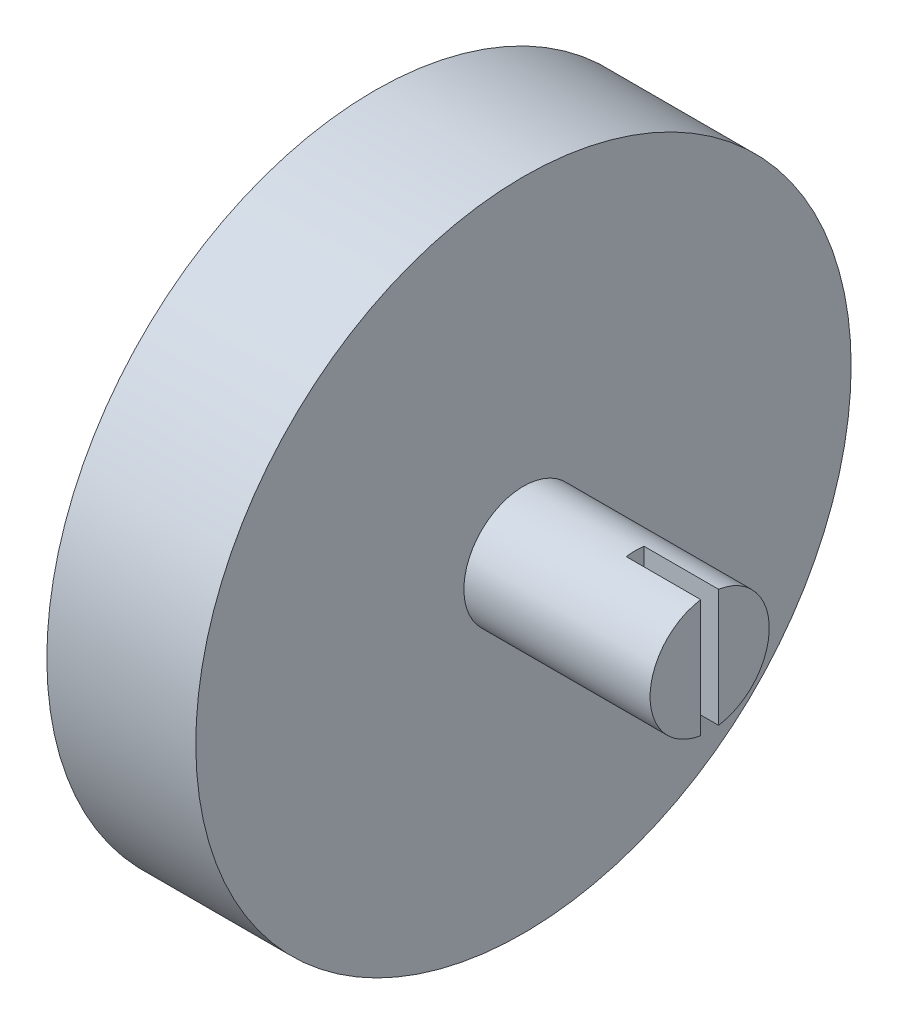
ISO-10303-21;
HEADER;
FILE_DESCRIPTION(('STEP AP214'),'2;1');
FILE_NAME('part.step','',(''),(''),'','','');
FILE_SCHEMA(('AUTOMOTIVE_DESIGN { 1 0 10303 214 1 1 1 1 }'));
ENDSEC;
DATA;
#1=APPLICATION_CONTEXT('core data for automotive mechanical design processes');
#2=APPLICATION_PROTOCOL_DEFINITION('international standard','automotive_design',2000,#1);
#3=PRODUCT_CONTEXT('',#1,'mechanical');
#4=PRODUCT('Part','Part','',(#3));
#5=PRODUCT_RELATED_PRODUCT_CATEGORY('part','',(#4));
#6=PRODUCT_DEFINITION_FORMATION('','',#4);
#7=PRODUCT_DEFINITION_CONTEXT('part definition',#1,'design');
#8=PRODUCT_DEFINITION('design','',#6,#7);
#9=PRODUCT_DEFINITION_SHAPE('','',#8);
#10=(LENGTH_UNIT() NAMED_UNIT(*) SI_UNIT(.MILLI.,.METRE.));
#11=(NAMED_UNIT(*) PLANE_ANGLE_UNIT() SI_UNIT($,.RADIAN.));
#12=(NAMED_UNIT(*) SI_UNIT($,.STERADIAN.) SOLID_ANGLE_UNIT());
#13=UNCERTAINTY_MEASURE_WITH_UNIT(LENGTH_MEASURE(1.E-05),#10,'distance_accuracy_value','');
#14=(GEOMETRIC_REPRESENTATION_CONTEXT(3) GLOBAL_UNCERTAINTY_ASSIGNED_CONTEXT((#13)) GLOBAL_UNIT_ASSIGNED_CONTEXT((#10,
#11,#12)) REPRESENTATION_CONTEXT('',''));
#15=CARTESIAN_POINT('',(0.,0.,0.));
#16=DIRECTION('',(0.,0.,1.));
#17=DIRECTION('',(1.,0.,0.));
#18=AXIS2_PLACEMENT_3D('',#15,#16,#17);
#19=CARTESIAN_POINT('',(5.5,19.5568517413347,6.50000000000001));
#20=DIRECTION('',(0.,0.,-1.));
#21=DIRECTION('',(0.,1.,0.));
#22=AXIS2_PLACEMENT_3D('',#19,#20,#21);
#23=PLANE('',#22);
#24=DIRECTION('',(-1.,0.,0.));
#25=VECTOR('',#24,1.);
#26=CARTESIAN_POINT('',(5.5,-6.94314825866529,6.5));
#27=LINE('',#26,#25);
#28=CARTESIAN_POINT('',(5.5,-6.94314825866529,6.5));
#29=VERTEX_POINT('',#28);
#30=CARTESIAN_POINT('',(4.25,-6.94314825866529,6.5));
#31=VERTEX_POINT('',#30);
#32=EDGE_CURVE('E469',#29,#31,#27,.T.);
#33=ORIENTED_EDGE('',*,*,#32,.T.);
#34=DIRECTION('',(0.,-1.,0.));
#35=VECTOR('',#34,1.);
#36=CARTESIAN_POINT('',(4.25,-5.94314825866529,6.5));
#37=LINE('',#36,#35);
#38=CARTESIAN_POINT('',(4.25,-5.94314825866529,6.5));
#39=VERTEX_POINT('',#38);
#40=EDGE_CURVE('E54',#39,#31,#37,.T.);
#41=ORIENTED_EDGE('',*,*,#40,.F.);
#42=DIRECTION('',(1.,0.,0.));
#43=VECTOR('',#42,1.);
#44=CARTESIAN_POINT('',(0.,-5.94314825866529,6.5));
#45=LINE('',#44,#43);
#46=CARTESIAN_POINT('',(3.,-5.94314825866529,6.5));
#47=VERTEX_POINT('',#46);
#48=EDGE_CURVE('E245',#47,#39,#45,.T.);
#49=ORIENTED_EDGE('',*,*,#48,.F.);
#50=DIRECTION('',(0.,1.,0.));
#51=VECTOR('',#50,1.);
#52=CARTESIAN_POINT('',(3.,19.5568517413347,6.50000000000001));
#53=LINE('',#52,#51);
#54=CARTESIAN_POINT('',(3.,17.1748906632346,6.50000000000001));
#55=VERTEX_POINT('',#54);
#56=EDGE_CURVE('E370',#47,#55,#53,.T.);
#57=ORIENTED_EDGE('',*,*,#56,.T.);
#58=DIRECTION('',(1.,0.,0.));
#59=VECTOR('',#58,1.);
#60=CARTESIAN_POINT('',(5.5,17.1748906632346,6.50000000000001));
#61=LINE('',#60,#59);
#62=CARTESIAN_POINT('',(0.,17.1748906632346,6.5));
#63=VERTEX_POINT('',#62);
#64=EDGE_CURVE('E383',#63,#55,#61,.T.);
#65=ORIENTED_EDGE('',*,*,#64,.F.);
#66=DIRECTION('',(0.,-1.,0.));
#67=VECTOR('',#66,1.);
#68=CARTESIAN_POINT('',(0.,19.5568517413347,6.50000000000001));
#69=LINE('',#68,#67);
#70=CARTESIAN_POINT('',(0.,19.5568517413347,6.50000000000001));
#71=VERTEX_POINT('',#70);
#72=EDGE_CURVE('E393',#71,#63,#69,.T.);
#73=ORIENTED_EDGE('',*,*,#72,.F.);
#74=DIRECTION('',(-1.,0.,0.));
#75=VECTOR('',#74,1.);
#76=CARTESIAN_POINT('',(5.5,19.5568517413347,6.50000000000001));
#77=LINE('',#76,#75);
#78=CARTESIAN_POINT('',(5.5,19.5568517413347,6.50000000000001));
#79=VERTEX_POINT('',#78);
#80=EDGE_CURVE('E465',#79,#71,#77,.T.);
#81=ORIENTED_EDGE('',*,*,#80,.F.);
#82=DIRECTION('',(0.,-1.,0.));
#83=VECTOR('',#82,1.);
#84=CARTESIAN_POINT('',(5.5,19.5568517413347,6.50000000000001));
#85=LINE('',#84,#83);
#86=EDGE_CURVE('E426',#79,#29,#85,.T.);
#87=ORIENTED_EDGE('',*,*,#86,.T.);
#88=EDGE_LOOP('',(#33,#41,#49,#57,#65,#73,#81,#87));
#89=FACE_BOUND('',#88,.T.);
#90=ADVANCED_FACE('F38',(#89),#23,.T.);
#91=CARTESIAN_POINT('',(5.5,-6.94314825866529,6.5));
#92=DIRECTION('',(0.,1.,0.));
#93=DIRECTION('',(0.,0.,1.));
#94=AXIS2_PLACEMENT_3D('',#91,#92,#93);
#95=PLANE('',#94);
#96=DIRECTION('',(0.,0.,1.));
#97=VECTOR('',#96,1.);
#98=CARTESIAN_POINT('',(3.,-6.9431482586653,9.00000000000001));
#99=LINE('',#98,#97);
#100=CARTESIAN_POINT('',(3.,-6.9431482586653,6.5));
#101=VERTEX_POINT('',#100);
#102=CARTESIAN_POINT('',(3.,-6.9431482586653,9.00000000000001));
#103=VERTEX_POINT('',#102);
#104=EDGE_CURVE('E339',#101,#103,#99,.T.);
#105=ORIENTED_EDGE('',*,*,#104,.F.);
#106=DIRECTION('',(1.,0.,0.));
#107=VECTOR('',#106,1.);
#108=CARTESIAN_POINT('',(0.,-6.94314825866529,6.5));
#109=LINE('',#108,#107);
#110=CARTESIAN_POINT('',(0.,-6.94314825866529,6.5));
#111=VERTEX_POINT('',#110);
#112=EDGE_CURVE('E694',#111,#101,#109,.T.);
#113=ORIENTED_EDGE('',*,*,#112,.F.);
#114=DIRECTION('',(0.,0.,-1.));
#115=VECTOR('',#114,1.);
#116=CARTESIAN_POINT('',(0.,-6.94314825866529,6.5));
#117=LINE('',#116,#115);
#118=CARTESIAN_POINT('',(0.,-6.9431482586653,9.00000000000001));
#119=VERTEX_POINT('',#118);
#120=EDGE_CURVE('E261',#119,#111,#117,.T.);
#121=ORIENTED_EDGE('',*,*,#120,.F.);
#122=DIRECTION('',(-1.,0.,0.));
#123=VECTOR('',#122,1.);
#124=CARTESIAN_POINT('',(3.,-6.9431482586653,9.00000000000001));
#125=LINE('',#124,#123);
#126=EDGE_CURVE('E374',#103,#119,#125,.T.);
#127=ORIENTED_EDGE('',*,*,#126,.F.);
#128=EDGE_LOOP('',(#105,#113,#121,#127));
#129=FACE_BOUND('',#128,.T.);
#130=ADVANCED_FACE('F627',(#129),#95,.T.);
#131=DIRECTION('',(-1.,0.,0.));
#132=VECTOR('',#131,1.);
#133=CARTESIAN_POINT('',(5.5,-6.94314825866529,4.76239289224447));
#134=LINE('',#133,#132);
#135=CARTESIAN_POINT('',(5.5,-6.94314825866529,4.76239289224447));
#136=VERTEX_POINT('',#135);
#137=CARTESIAN_POINT('',(4.25,-6.94314825866529,4.76239289224447));
#138=VERTEX_POINT('',#137);
#139=EDGE_CURVE('E472',#136,#138,#134,.T.);
#140=ORIENTED_EDGE('',*,*,#139,.T.);
#141=DIRECTION('',(0.,0.,-1.));
#142=VECTOR('',#141,1.);
#143=CARTESIAN_POINT('',(4.25,-6.94314825866529,4.76239289224447));
#144=LINE('',#143,#142);
#145=EDGE_CURVE('E62',#31,#138,#144,.T.);
#146=ORIENTED_EDGE('',*,*,#145,.F.);
#147=ORIENTED_EDGE('',*,*,#32,.F.);
#148=DIRECTION('',(0.,0.,-1.));
#149=VECTOR('',#148,1.);
#150=CARTESIAN_POINT('',(5.5,-6.94314825866529,6.5));
#151=LINE('',#150,#149);
#152=EDGE_CURVE('E423',#29,#136,#151,.T.);
#153=ORIENTED_EDGE('',*,*,#152,.T.);
#154=EDGE_LOOP('',(#140,#146,#147,#153));
#155=FACE_BOUND('',#154,.T.);
#156=ADVANCED_FACE('F632',(#155),#95,.T.);
#157=CARTESIAN_POINT('',(5.5,-6.94314825866529,-6.5));
#158=DIRECTION('',(0.,-1.,0.));
#159=DIRECTION('',(0.,0.,-1.));
#160=AXIS2_PLACEMENT_3D('',#157,#158,#159);
#161=PLANE('',#160);
#162=DIRECTION('',(0.,0.,-1.));
#163=VECTOR('',#162,1.);
#164=CARTESIAN_POINT('',(4.,-6.94314825866529,-6.51239289224447));
#165=LINE('',#164,#163);
#166=CARTESIAN_POINT('',(4.,-6.94314825866529,-4.76239289224447));
#167=VERTEX_POINT('',#166);
#168=CARTESIAN_POINT('',(4.,-6.94314825866529,-6.5));
#169=VERTEX_POINT('',#168);
#170=EDGE_CURVE('E263',#167,#169,#165,.T.);
#171=ORIENTED_EDGE('',*,*,#170,.F.);
#172=DIRECTION('',(-1.,0.,0.));
#173=VECTOR('',#172,1.);
#174=CARTESIAN_POINT('',(5.5,-6.94314825866529,-4.76239289224447));
#175=LINE('',#174,#173);
#176=CARTESIAN_POINT('',(5.5,-6.94314825866529,-4.76239289224447));
#177=VERTEX_POINT('',#176);
#178=EDGE_CURVE('E494',#177,#167,#175,.T.);
#179=ORIENTED_EDGE('',*,*,#178,.F.);
#180=DIRECTION('',(0.,0.,1.));
#181=VECTOR('',#180,1.);
#182=CARTESIAN_POINT('',(5.5,-6.94314825866529,-6.5));
#183=LINE('',#182,#181);
#184=CARTESIAN_POINT('',(5.5,-6.94314825866529,-6.5));
#185=VERTEX_POINT('',#184);
#186=EDGE_CURVE('E397',#185,#177,#183,.T.);
#187=ORIENTED_EDGE('',*,*,#186,.F.);
#188=DIRECTION('',(-1.,0.,0.));
#189=VECTOR('',#188,1.);
#190=CARTESIAN_POINT('',(5.5,-6.94314825866529,-6.5));
#191=LINE('',#190,#189);
#192=EDGE_CURVE('E498',#185,#169,#191,.T.);
#193=ORIENTED_EDGE('',*,*,#192,.T.);
#194=EDGE_LOOP('',(#171,#179,#187,#193));
#195=FACE_BOUND('',#194,.T.);
#196=ADVANCED_FACE('F563',(#195),#161,.F.);
#197=DIRECTION('',(-1.,0.,0.));
#198=VECTOR('',#197,1.);
#199=CARTESIAN_POINT('',(0.,-6.94314825866529,-6.51239289224447));
#200=LINE('',#199,#198);
#201=CARTESIAN_POINT('',(3.,-6.94314825866529,-6.51239289224447));
#202=VERTEX_POINT('',#201);
#203=CARTESIAN_POINT('',(0.,-6.94314825866529,-6.51239289224447));
#204=VERTEX_POINT('',#203);
#205=EDGE_CURVE('E267',#202,#204,#200,.T.);
#206=ORIENTED_EDGE('',*,*,#205,.F.);
#207=CARTESIAN_POINT('',(3.,-6.9431482586653,-9.));
#208=VERTEX_POINT('',#207);
#209=EDGE_CURVE('E341',#208,#202,#99,.T.);
#210=ORIENTED_EDGE('',*,*,#209,.F.);
#211=DIRECTION('',(-1.,0.,0.));
#212=VECTOR('',#211,1.);
#213=CARTESIAN_POINT('',(3.,-6.9431482586653,-9.));
#214=LINE('',#213,#212);
#215=CARTESIAN_POINT('',(0.,-6.9431482586653,-9.));
#216=VERTEX_POINT('',#215);
#217=EDGE_CURVE('E354',#208,#216,#214,.T.);
#218=ORIENTED_EDGE('',*,*,#217,.T.);
#219=DIRECTION('',(0.,0.,1.));
#220=VECTOR('',#219,1.);
#221=CARTESIAN_POINT('',(0.,-6.94314825866529,-6.5));
#222=LINE('',#221,#220);
#223=EDGE_CURVE('E436',#216,#204,#222,.T.);
#224=ORIENTED_EDGE('',*,*,#223,.T.);
#225=EDGE_LOOP('',(#206,#210,#218,#224));
#226=FACE_BOUND('',#225,.T.);
#227=ADVANCED_FACE('F545',(#226),#161,.F.);
#228=CARTESIAN_POINT('',(5.5,19.5568517413347,-6.49999999999999));
#229=DIRECTION('',(0.,0.,-1.));
#230=DIRECTION('',(0.,1.,0.));
#231=AXIS2_PLACEMENT_3D('',#228,#229,#230);
#232=PLANE('',#231);
#233=DIRECTION('',(0.,1.,0.));
#234=VECTOR('',#233,1.);
#235=CARTESIAN_POINT('',(4.,19.5568517413347,-6.49999999999999));
#236=LINE('',#235,#234);
#237=CARTESIAN_POINT('',(4.,-5.94314825866529,-6.5));
#238=VERTEX_POINT('',#237);
#239=EDGE_CURVE('E11',#169,#238,#236,.T.);
#240=ORIENTED_EDGE('',*,*,#239,.F.);
#241=ORIENTED_EDGE('',*,*,#192,.F.);
#242=DIRECTION('',(0.,-1.,0.));
#243=VECTOR('',#242,1.);
#244=CARTESIAN_POINT('',(5.5,19.5568517413347,-6.49999999999999));
#245=LINE('',#244,#243);
#246=CARTESIAN_POINT('',(5.5,19.5568517413347,-6.49999999999999));
#247=VERTEX_POINT('',#246);
#248=EDGE_CURVE('E392',#247,#185,#245,.T.);
#249=ORIENTED_EDGE('',*,*,#248,.F.);
#250=DIRECTION('',(-1.,0.,0.));
#251=VECTOR('',#250,1.);
#252=CARTESIAN_POINT('',(5.5,19.5568517413347,-6.49999999999999));
#253=LINE('',#252,#251);
#254=CARTESIAN_POINT('',(0.,19.5568517413347,-6.49999999999999));
#255=VERTEX_POINT('',#254);
#256=EDGE_CURVE('E429',#247,#255,#253,.T.);
#257=ORIENTED_EDGE('',*,*,#256,.T.);
#258=DIRECTION('',(0.,-1.,0.));
#259=VECTOR('',#258,1.);
#260=CARTESIAN_POINT('',(0.,19.5568517413347,-6.49999999999999));
#261=LINE('',#260,#259);
#262=CARTESIAN_POINT('',(0.,17.1748906632345,-6.5));
#263=VERTEX_POINT('',#262);
#264=EDGE_CURVE('E432',#255,#263,#261,.T.);
#265=ORIENTED_EDGE('',*,*,#264,.T.);
#266=DIRECTION('',(1.,0.,0.));
#267=VECTOR('',#266,1.);
#268=CARTESIAN_POINT('',(5.5,17.1748906632345,-6.49999999999999));
#269=LINE('',#268,#267);
#270=CARTESIAN_POINT('',(3.,17.1748906632345,-6.5));
#271=VERTEX_POINT('',#270);
#272=EDGE_CURVE('E334',#263,#271,#269,.T.);
#273=ORIENTED_EDGE('',*,*,#272,.T.);
#274=DIRECTION('',(0.,1.,0.));
#275=VECTOR('',#274,1.);
#276=CARTESIAN_POINT('',(3.,19.5568517413347,-6.49999999999999));
#277=LINE('',#276,#275);
#278=CARTESIAN_POINT('',(3.,-5.94314825866529,-6.5));
#279=VERTEX_POINT('',#278);
#280=EDGE_CURVE('E515',#279,#271,#277,.T.);
#281=ORIENTED_EDGE('',*,*,#280,.F.);
#282=DIRECTION('',(-1.,0.,0.));
#283=VECTOR('',#282,1.);
#284=CARTESIAN_POINT('',(5.5,-5.94314825866529,-6.5));
#285=LINE('',#284,#283);
#286=EDGE_CURVE('E297',#238,#279,#285,.T.);
#287=ORIENTED_EDGE('',*,*,#286,.F.);
#288=EDGE_LOOP('',(#240,#241,#249,#257,#265,#273,#281,#287));
#289=FACE_BOUND('',#288,.T.);
#290=ADVANCED_FACE('F567',(#289),#232,.F.);
#291=CARTESIAN_POINT('',(3.,0.,0.));
#292=DIRECTION('',(-1.,0.,0.));
#293=DIRECTION('',(0.,0.,1.));
#294=AXIS2_PLACEMENT_3D('',#291,#292,#293);
#295=PLANE('',#294);
#296=ORIENTED_EDGE('',*,*,#209,.T.);
#297=DIRECTION('',(0.,1.,0.));
#298=VECTOR('',#297,1.);
#299=CARTESIAN_POINT('',(3.,0.,-6.51239289224447));
#300=LINE('',#299,#298);
#301=CARTESIAN_POINT('',(3.,-5.94314825866529,-6.51239289224447));
#302=VERTEX_POINT('',#301);
#303=EDGE_CURVE('E47',#202,#302,#300,.T.);
#304=ORIENTED_EDGE('',*,*,#303,.T.);
#305=DIRECTION('',(0.,0.,1.));
#306=VECTOR('',#305,1.);
#307=CARTESIAN_POINT('',(3.,-5.94314825866529,0.));
#308=LINE('',#307,#306);
#309=EDGE_CURVE('E530',#302,#279,#308,.T.);
#310=ORIENTED_EDGE('',*,*,#309,.T.);
#311=ORIENTED_EDGE('',*,*,#280,.T.);
#312=DIRECTION('',(0.,0.,-1.));
#313=VECTOR('',#312,1.);
#314=CARTESIAN_POINT('',(3.,17.1748906632346,9.));
#315=LINE('',#314,#313);
#316=CARTESIAN_POINT('',(3.,17.1748906632345,-9.00000000000001));
#317=VERTEX_POINT('',#316);
#318=EDGE_CURVE('E349',#271,#317,#315,.T.);
#319=ORIENTED_EDGE('',*,*,#318,.T.);
#320=DIRECTION('',(0.,-1.,0.));
#321=VECTOR('',#320,1.);
#322=CARTESIAN_POINT('',(3.,-6.9431482586653,-9.));
#323=LINE('',#322,#321);
#324=EDGE_CURVE('E335',#317,#208,#323,.T.);
#325=ORIENTED_EDGE('',*,*,#324,.T.);
#326=EDGE_LOOP('',(#296,#304,#310,#311,#319,#325));
#327=FACE_BOUND('',#326,.T.);
#328=ADVANCED_FACE('F536',(#327),#295,.T.);
#329=CARTESIAN_POINT('',(22.5,0.,0.));
#330=DIRECTION('',(1.,0.,0.));
#331=DIRECTION('',(0.,0.,-1.));
#332=AXIS2_PLACEMENT_3D('',#329,#330,#331);
#333=PLANE('',#332);
#334=DIRECTION('',(0.,-1.,0.));
#335=VECTOR('',#334,1.);
#336=CARTESIAN_POINT('',(22.5,0.,0.6));
#337=LINE('',#336,#335);
#338=CARTESIAN_POINT('',(22.5,3.95474398665704,0.600000000000001));
#339=VERTEX_POINT('',#338);
#340=CARTESIAN_POINT('',(22.5,-3.95474398665704,0.6));
#341=VERTEX_POINT('',#340);
#342=EDGE_CURVE('E523',#339,#341,#337,.T.);
#343=ORIENTED_EDGE('',*,*,#342,.F.);
#344=CARTESIAN_POINT('',(22.5,0.,0.));
#345=DIRECTION('',(1.,0.,0.));
#346=DIRECTION('',(0.,0.,-1.));
#347=AXIS2_PLACEMENT_3D('',#344,#345,#346);
#348=CIRCLE('',#347,4.);
#349=EDGE_CURVE('E328',#339,#341,#348,.T.);
#350=ORIENTED_EDGE('',*,*,#349,.T.);
#351=EDGE_LOOP('',(#343,#350));
#352=FACE_BOUND('',#351,.T.);
#353=ADVANCED_FACE('F582',(#352),#333,.T.);
#354=CARTESIAN_POINT('',(10.,0.,0.));
#355=DIRECTION('',(-1.,0.,0.));
#356=DIRECTION('',(0.,0.,1.));
#357=AXIS2_PLACEMENT_3D('',#354,#355,#356);
#358=CYLINDRICAL_SURFACE('',#357,22.);
#359=CARTESIAN_POINT('',(0.,0.,0.));
#360=DIRECTION('',(1.,0.,0.));
#361=DIRECTION('',(0.,0.,-1.));
#362=AXIS2_PLACEMENT_3D('',#359,#360,#361);
#363=CIRCLE('',#362,22.);
#364=CARTESIAN_POINT('',(0.,-21.837327130716,-2.67042015160433));
#365=VERTEX_POINT('',#364);
#366=CARTESIAN_POINT('',(0.,-21.837327130716,2.67042015160434));
#367=VERTEX_POINT('',#366);
#368=EDGE_CURVE('E468',#365,#367,#363,.T.);
#369=ORIENTED_EDGE('',*,*,#368,.T.);
#370=DIRECTION('',(-1.,0.,0.));
#371=VECTOR('',#370,1.);
#372=CARTESIAN_POINT('',(5.5,-21.837327130716,2.67042015160434));
#373=LINE('',#372,#371);
#374=CARTESIAN_POINT('',(5.5,-21.837327130716,2.67042015160434));
#375=VERTEX_POINT('',#374);
#376=EDGE_CURVE('E481',#375,#367,#373,.T.);
#377=ORIENTED_EDGE('',*,*,#376,.F.);
#378=CARTESIAN_POINT('',(5.5,0.,0.));
#379=DIRECTION('',(1.,0.,0.));
#380=DIRECTION('',(0.,0.,-1.));
#381=AXIS2_PLACEMENT_3D('',#378,#379,#380);
#382=CIRCLE('',#381,22.);
#383=CARTESIAN_POINT('',(5.5,-21.837327130716,-2.67042015160433));
#384=VERTEX_POINT('',#383);
#385=EDGE_CURVE('E509',#375,#384,#382,.T.);
#386=ORIENTED_EDGE('',*,*,#385,.T.);
#387=DIRECTION('',(-1.,0.,0.));
#388=VECTOR('',#387,1.);
#389=CARTESIAN_POINT('',(5.5,-21.837327130716,-2.67042015160433));
#390=LINE('',#389,#388);
#391=EDGE_CURVE('E484',#384,#365,#390,.T.);
#392=ORIENTED_EDGE('',*,*,#391,.T.);
#393=EDGE_LOOP('',(#369,#377,#386,#392));
#394=FACE_BOUND('',#393,.T.);
#395=CARTESIAN_POINT('',(10.,0.,0.));
#396=DIRECTION('',(1.,0.,0.));
#397=DIRECTION('',(0.,0.,-1.));
#398=AXIS2_PLACEMENT_3D('',#395,#396,#397);
#399=CIRCLE('',#398,22.);
#400=CARTESIAN_POINT('',(10.,0.,-22.));
#401=VERTEX_POINT('',#400);
#402=EDGE_CURVE('E505',#401,#401,#399,.T.);
#403=ORIENTED_EDGE('',*,*,#402,.F.);
#404=EDGE_LOOP('',(#403));
#405=FACE_BOUND('',#404,.T.);
#406=ADVANCED_FACE('F40',(#394,#405),#358,.T.);
#407=CARTESIAN_POINT('',(10.,0.,0.));
#408=DIRECTION('',(1.,0.,0.));
#409=DIRECTION('',(0.,0.,-1.));
#410=AXIS2_PLACEMENT_3D('',#407,#408,#409);
#411=PLANE('',#410);
#412=CARTESIAN_POINT('',(10.,0.,0.));
#413=DIRECTION('',(1.,0.,0.));
#414=DIRECTION('',(0.,0.,-1.));
#415=AXIS2_PLACEMENT_3D('',#412,#413,#414);
#416=CIRCLE('',#415,4.);
#417=CARTESIAN_POINT('',(10.,0.,-4.));
#418=VERTEX_POINT('',#417);
#419=EDGE_CURVE('E329',#418,#418,#416,.T.);
#420=ORIENTED_EDGE('',*,*,#419,.F.);
#421=EDGE_LOOP('',(#420));
#422=FACE_BOUND('',#421,.T.);
#423=ORIENTED_EDGE('',*,*,#402,.T.);
#424=EDGE_LOOP('',(#423));
#425=FACE_BOUND('',#424,.T.);
#426=ADVANCED_FACE('F664',(#422,#425),#411,.T.);
#427=CARTESIAN_POINT('',(0.,0.,0.));
#428=DIRECTION('',(1.,0.,0.));
#429=DIRECTION('',(0.,0.,-1.));
#430=AXIS2_PLACEMENT_3D('',#427,#428,#429);
#431=PLANE('',#430);
#432=CARTESIAN_POINT('',(0.,0.,14.));
#433=DIRECTION('',(1.,0.,0.));
#434=DIRECTION('',(0.,0.,-1.));
#435=AXIS2_PLACEMENT_3D('',#432,#433,#434);
#436=CIRCLE('',#435,1.5);
#437=CARTESIAN_POINT('',(0.,0.,12.5));
#438=VERTEX_POINT('',#437);
#439=EDGE_CURVE('E677',#438,#438,#436,.T.);
#440=ORIENTED_EDGE('',*,*,#439,.T.);
#441=EDGE_LOOP('',(#440));
#442=FACE_BOUND('',#441,.T.);
#443=CARTESIAN_POINT('',(0.,0.,-14.));
#444=DIRECTION('',(1.,0.,0.));
#445=DIRECTION('',(0.,0.,-1.));
#446=AXIS2_PLACEMENT_3D('',#443,#444,#445);
#447=CIRCLE('',#446,1.5);
#448=CARTESIAN_POINT('',(0.,0.,-15.5));
#449=VERTEX_POINT('',#448);
#450=EDGE_CURVE('E680',#449,#449,#447,.T.);
#451=ORIENTED_EDGE('',*,*,#450,.T.);
#452=EDGE_LOOP('',(#451));
#453=FACE_BOUND('',#452,.T.);
#454=ORIENTED_EDGE('',*,*,#72,.T.);
#455=DIRECTION('',(0.,0.,-1.));
#456=VECTOR('',#455,1.);
#457=CARTESIAN_POINT('',(0.,17.1748906632346,9.));
#458=LINE('',#457,#456);
#459=CARTESIAN_POINT('',(0.,17.1748906632346,9.));
#460=VERTEX_POINT('',#459);
#461=EDGE_CURVE('E340',#460,#63,#458,.T.);
#462=ORIENTED_EDGE('',*,*,#461,.F.);
#463=DIRECTION('',(0.,1.,0.));
#464=VECTOR('',#463,1.);
#465=CARTESIAN_POINT('',(0.,17.1748906632346,9.));
#466=LINE('',#465,#464);
#467=EDGE_CURVE('E359',#119,#460,#466,.T.);
#468=ORIENTED_EDGE('',*,*,#467,.F.);
#469=ORIENTED_EDGE('',*,*,#120,.T.);
#470=DIRECTION('',(0.,-1.,0.));
#471=VECTOR('',#470,1.);
#472=CARTESIAN_POINT('',(0.,-5.94314825866529,6.5));
#473=LINE('',#472,#471);
#474=CARTESIAN_POINT('',(0.,-5.94314825866529,6.5));
#475=VERTEX_POINT('',#474);
#476=EDGE_CURVE('E240',#475,#111,#473,.T.);
#477=ORIENTED_EDGE('',*,*,#476,.F.);
#478=DIRECTION('',(0.,0.,1.));
#479=VECTOR('',#478,1.);
#480=CARTESIAN_POINT('',(0.,-5.94314825866529,4.76239289224447));
#481=LINE('',#480,#479);
#482=CARTESIAN_POINT('',(0.,-5.94314825866529,4.76239289224447));
#483=VERTEX_POINT('',#482);
#484=EDGE_CURVE('E249',#483,#475,#481,.T.);
#485=ORIENTED_EDGE('',*,*,#484,.F.);
#486=DIRECTION('',(0.,1.,0.));
#487=VECTOR('',#486,1.);
#488=CARTESIAN_POINT('',(0.,-10.,4.76239289224447));
#489=LINE('',#488,#487);
#490=CARTESIAN_POINT('',(0.,-10.,4.76239289224447));
#491=VERTEX_POINT('',#490);
#492=EDGE_CURVE('E458',#491,#483,#489,.T.);
#493=ORIENTED_EDGE('',*,*,#492,.F.);
#494=DIRECTION('',(0.,-0.952328688194239,-0.305073875712489));
#495=VECTOR('',#494,1.);
#496=CARTESIAN_POINT('',(0.,-10.,4.76239289224447));
#497=LINE('',#496,#495);
#498=CARTESIAN_POINT('',(0.,-16.5303712131336,2.67042015160433));
#499=VERTEX_POINT('',#498);
#500=EDGE_CURVE('E454',#491,#499,#497,.T.);
#501=ORIENTED_EDGE('',*,*,#500,.T.);
#502=DIRECTION('',(0.,1.,0.));
#503=VECTOR('',#502,1.);
#504=CARTESIAN_POINT('',(0.,-16.8581606699215,2.67042015160433));
#505=LINE('',#504,#503);
#506=EDGE_CURVE('E450',#367,#499,#505,.T.);
#507=ORIENTED_EDGE('',*,*,#506,.F.);
#508=ORIENTED_EDGE('',*,*,#368,.F.);
#509=DIRECTION('',(0.,-1.,0.));
#510=VECTOR('',#509,1.);
#511=CARTESIAN_POINT('',(0.,-16.8581606699215,-2.67042015160433));
#512=LINE('',#511,#510);
#513=CARTESIAN_POINT('',(0.,-16.5303712131336,-2.67042015160434));
#514=VERTEX_POINT('',#513);
#515=EDGE_CURVE('E447',#514,#365,#512,.T.);
#516=ORIENTED_EDGE('',*,*,#515,.F.);
#517=DIRECTION('',(0.,-0.95232868819424,0.305073875712488));
#518=VECTOR('',#517,1.);
#519=CARTESIAN_POINT('',(0.,-10.,-4.76239289224447));
#520=LINE('',#519,#518);
#521=CARTESIAN_POINT('',(0.,-10.,-4.76239289224447));
#522=VERTEX_POINT('',#521);
#523=EDGE_CURVE('E443',#522,#514,#520,.T.);
#524=ORIENTED_EDGE('',*,*,#523,.F.);
#525=DIRECTION('',(0.,1.,0.));
#526=VECTOR('',#525,1.);
#527=CARTESIAN_POINT('',(0.,-10.,-4.76239289224447));
#528=LINE('',#527,#526);
#529=CARTESIAN_POINT('',(0.,-5.94314825866529,-4.76239289224447));
#530=VERTEX_POINT('',#529);
#531=EDGE_CURVE('E440',#522,#530,#528,.T.);
#532=ORIENTED_EDGE('',*,*,#531,.T.);
#533=DIRECTION('',(0.,0.,1.));
#534=VECTOR('',#533,1.);
#535=CARTESIAN_POINT('',(0.,-5.94314825866529,-4.76239289224447));
#536=LINE('',#535,#534);
#537=CARTESIAN_POINT('',(0.,-5.94314825866529,-6.51239289224447));
#538=VERTEX_POINT('',#537);
#539=EDGE_CURVE('E284',#538,#530,#536,.T.);
#540=ORIENTED_EDGE('',*,*,#539,.F.);
#541=DIRECTION('',(0.,-1.,0.));
#542=VECTOR('',#541,1.);
#543=CARTESIAN_POINT('',(0.,-5.94314825866529,-6.51239289224447));
#544=LINE('',#543,#542);
#545=EDGE_CURVE('E287',#538,#204,#544,.T.);
#546=ORIENTED_EDGE('',*,*,#545,.T.);
#547=ORIENTED_EDGE('',*,*,#223,.F.);
#548=DIRECTION('',(0.,-1.,0.));
#549=VECTOR('',#548,1.);
#550=CARTESIAN_POINT('',(0.,-6.9431482586653,-9.));
#551=LINE('',#550,#549);
#552=CARTESIAN_POINT('',(0.,17.1748906632345,-9.00000000000001));
#553=VERTEX_POINT('',#552);
#554=EDGE_CURVE('E355',#553,#216,#551,.T.);
#555=ORIENTED_EDGE('',*,*,#554,.F.);
#556=EDGE_CURVE('E363',#263,#553,#458,.T.);
#557=ORIENTED_EDGE('',*,*,#556,.F.);
#558=ORIENTED_EDGE('',*,*,#264,.F.);
#559=DIRECTION('',(0.,0.,-1.));
#560=VECTOR('',#559,1.);
#561=CARTESIAN_POINT('',(0.,19.5568517413347,6.50000000000001));
#562=LINE('',#561,#560);
#563=EDGE_CURVE('E387',#71,#255,#562,.T.);
#564=ORIENTED_EDGE('',*,*,#563,.F.);
#565=EDGE_LOOP('',(#454,#462,#468,#469,#477,#485,#493,#501,#507,#508,#516,#524,#532,#540,#546,
#547,#555,#557,#558,#564));
#566=FACE_BOUND('',#565,.T.);
#567=ADVANCED_FACE('F259',(#442,#453,#566),#431,.F.);
#568=CARTESIAN_POINT('',(5.5,0.,0.));
#569=DIRECTION('',(1.,0.,0.));
#570=DIRECTION('',(0.,0.,-1.));
#571=AXIS2_PLACEMENT_3D('',#568,#569,#570);
#572=PLANE('',#571);
#573=ORIENTED_EDGE('',*,*,#385,.F.);
#574=DIRECTION('',(0.,-1.,0.));
#575=VECTOR('',#574,1.);
#576=CARTESIAN_POINT('',(5.5,-16.8581606699215,2.67042015160433));
#577=LINE('',#576,#575);
#578=CARTESIAN_POINT('',(5.5,-16.5303712131336,2.67042015160433));
#579=VERTEX_POINT('',#578);
#580=EDGE_CURVE('E411',#579,#375,#577,.T.);
#581=ORIENTED_EDGE('',*,*,#580,.F.);
#582=DIRECTION('',(0.,-0.952328688194239,-0.305073875712489));
#583=VECTOR('',#582,1.);
#584=CARTESIAN_POINT('',(5.5,-10.,4.76239289224447));
#585=LINE('',#584,#583);
#586=CARTESIAN_POINT('',(5.5,-10.,4.76239289224447));
#587=VERTEX_POINT('',#586);
#588=EDGE_CURVE('E415',#587,#579,#585,.T.);
#589=ORIENTED_EDGE('',*,*,#588,.F.);
#590=DIRECTION('',(0.,1.,0.));
#591=VECTOR('',#590,1.);
#592=CARTESIAN_POINT('',(5.5,-10.,4.76239289224447));
#593=LINE('',#592,#591);
#594=EDGE_CURVE('E419',#587,#136,#593,.T.);
#595=ORIENTED_EDGE('',*,*,#594,.T.);
#596=ORIENTED_EDGE('',*,*,#152,.F.);
#597=ORIENTED_EDGE('',*,*,#86,.F.);
#598=DIRECTION('',(0.,0.,-1.));
#599=VECTOR('',#598,1.);
#600=CARTESIAN_POINT('',(5.5,19.5568517413347,6.50000000000001));
#601=LINE('',#600,#599);
#602=EDGE_CURVE('E388',#79,#247,#601,.T.);
#603=ORIENTED_EDGE('',*,*,#602,.T.);
#604=ORIENTED_EDGE('',*,*,#248,.T.);
#605=ORIENTED_EDGE('',*,*,#186,.T.);
#606=DIRECTION('',(0.,1.,0.));
#607=VECTOR('',#606,1.);
#608=CARTESIAN_POINT('',(5.5,-10.,-4.76239289224447));
#609=LINE('',#608,#607);
#610=CARTESIAN_POINT('',(5.5,-10.,-4.76239289224447));
#611=VERTEX_POINT('',#610);
#612=EDGE_CURVE('E401',#611,#177,#609,.T.);
#613=ORIENTED_EDGE('',*,*,#612,.F.);
#614=DIRECTION('',(0.,-0.95232868819424,0.305073875712488));
#615=VECTOR('',#614,1.);
#616=CARTESIAN_POINT('',(5.5,-10.,-4.76239289224447));
#617=LINE('',#616,#615);
#618=CARTESIAN_POINT('',(5.5,-16.5303712131336,-2.67042015160434));
#619=VERTEX_POINT('',#618);
#620=EDGE_CURVE('E404',#611,#619,#617,.T.);
#621=ORIENTED_EDGE('',*,*,#620,.T.);
#622=DIRECTION('',(0.,1.,0.));
#623=VECTOR('',#622,1.);
#624=CARTESIAN_POINT('',(5.5,-16.8581606699215,-2.67042015160433));
#625=LINE('',#624,#623);
#626=EDGE_CURVE('E408',#384,#619,#625,.T.);
#627=ORIENTED_EDGE('',*,*,#626,.F.);
#628=EDGE_LOOP('',(#573,#581,#589,#595,#596,#597,#603,#604,#605,#613,#621,#627));
#629=FACE_BOUND('',#628,.T.);
#630=ADVANCED_FACE('F612',(#629),#572,.F.);
#631=CARTESIAN_POINT('',(5.5,19.5568517413347,6.50000000000001));
#632=DIRECTION('',(0.,1.,0.));
#633=DIRECTION('',(0.,0.,1.));
#634=AXIS2_PLACEMENT_3D('',#631,#632,#633);
#635=PLANE('',#634);
#636=ORIENTED_EDGE('',*,*,#563,.T.);
#637=ORIENTED_EDGE('',*,*,#256,.F.);
#638=ORIENTED_EDGE('',*,*,#602,.F.);
#639=ORIENTED_EDGE('',*,*,#80,.T.);
#640=EDGE_LOOP('',(#636,#637,#638,#639));
#641=FACE_BOUND('',#640,.T.);
#642=ADVANCED_FACE('F613',(#641),#635,.F.);
#643=CARTESIAN_POINT('',(5.5,-10.,4.76239289224447));
#644=DIRECTION('',(0.,0.,1.));
#645=DIRECTION('',(1.,0.,0.));
#646=AXIS2_PLACEMENT_3D('',#643,#644,#645);
#647=PLANE('',#646);
#648=ORIENTED_EDGE('',*,*,#492,.T.);
#649=DIRECTION('',(-1.,0.,0.));
#650=VECTOR('',#649,1.);
#651=CARTESIAN_POINT('',(0.,-5.94314825866529,4.76239289224447));
#652=LINE('',#651,#650);
#653=CARTESIAN_POINT('',(4.25,-5.94314825866529,4.76239289224447));
#654=VERTEX_POINT('',#653);
#655=EDGE_CURVE('E252',#654,#483,#652,.T.);
#656=ORIENTED_EDGE('',*,*,#655,.F.);
#657=DIRECTION('',(0.,-1.,0.));
#658=VECTOR('',#657,1.);
#659=CARTESIAN_POINT('',(4.25,-5.94314825866529,4.76239289224447));
#660=LINE('',#659,#658);
#661=EDGE_CURVE('E269',#654,#138,#660,.T.);
#662=ORIENTED_EDGE('',*,*,#661,.T.);
#663=ORIENTED_EDGE('',*,*,#139,.F.);
#664=ORIENTED_EDGE('',*,*,#594,.F.);
#665=DIRECTION('',(-1.,0.,0.));
#666=VECTOR('',#665,1.);
#667=CARTESIAN_POINT('',(5.5,-10.,4.76239289224447));
#668=LINE('',#667,#666);
#669=EDGE_CURVE('E475',#587,#491,#668,.T.);
#670=ORIENTED_EDGE('',*,*,#669,.T.);
#671=EDGE_LOOP('',(#648,#656,#662,#663,#664,#670));
#672=FACE_BOUND('',#671,.T.);
#673=ADVANCED_FACE('F636',(#672),#647,.F.);
#674=CARTESIAN_POINT('',(5.5,-10.,4.76239289224447));
#675=DIRECTION('',(0.,0.305073875712489,-0.952328688194239));
#676=DIRECTION('',(0.,0.952328688194239,0.305073875712489));
#677=AXIS2_PLACEMENT_3D('',#674,#675,#676);
#678=PLANE('',#677);
#679=ORIENTED_EDGE('',*,*,#500,.F.);
#680=ORIENTED_EDGE('',*,*,#669,.F.);
#681=ORIENTED_EDGE('',*,*,#588,.T.);
#682=DIRECTION('',(-1.,0.,0.));
#683=VECTOR('',#682,1.);
#684=CARTESIAN_POINT('',(5.5,-16.5303712131336,2.67042015160433));
#685=LINE('',#684,#683);
#686=EDGE_CURVE('E478',#579,#499,#685,.T.);
#687=ORIENTED_EDGE('',*,*,#686,.T.);
#688=EDGE_LOOP('',(#679,#680,#681,#687));
#689=FACE_BOUND('',#688,.T.);
#690=ADVANCED_FACE('F639',(#689),#678,.T.);
#691=CARTESIAN_POINT('',(5.5,-16.8581606699215,2.67042015160433));
#692=DIRECTION('',(0.,0.,1.));
#693=DIRECTION('',(1.,0.,0.));
#694=AXIS2_PLACEMENT_3D('',#691,#692,#693);
#695=PLANE('',#694);
#696=ORIENTED_EDGE('',*,*,#506,.T.);
#697=ORIENTED_EDGE('',*,*,#686,.F.);
#698=ORIENTED_EDGE('',*,*,#580,.T.);
#699=ORIENTED_EDGE('',*,*,#376,.T.);
#700=EDGE_LOOP('',(#696,#697,#698,#699));
#701=FACE_BOUND('',#700,.T.);
#702=ADVANCED_FACE('F643',(#701),#695,.F.);
#703=CARTESIAN_POINT('',(5.5,-16.8581606699215,-2.67042015160433));
#704=DIRECTION('',(0.,0.,-1.));
#705=DIRECTION('',(-1.,0.,0.));
#706=AXIS2_PLACEMENT_3D('',#703,#704,#705);
#707=PLANE('',#706);
#708=ORIENTED_EDGE('',*,*,#515,.T.);
#709=ORIENTED_EDGE('',*,*,#391,.F.);
#710=ORIENTED_EDGE('',*,*,#626,.T.);
#711=DIRECTION('',(-1.,0.,0.));
#712=VECTOR('',#711,1.);
#713=CARTESIAN_POINT('',(5.5,-16.5303712131336,-2.67042015160434));
#714=LINE('',#713,#712);
#715=EDGE_CURVE('E488',#619,#514,#714,.T.);
#716=ORIENTED_EDGE('',*,*,#715,.T.);
#717=EDGE_LOOP('',(#708,#709,#710,#716));
#718=FACE_BOUND('',#717,.T.);
#719=ADVANCED_FACE('F647',(#718),#707,.F.);
#720=CARTESIAN_POINT('',(5.5,-10.,-4.76239289224447));
#721=DIRECTION('',(0.,-0.305073875712488,-0.95232868819424));
#722=DIRECTION('',(0.,0.95232868819424,-0.305073875712488));
#723=AXIS2_PLACEMENT_3D('',#720,#721,#722);
#724=PLANE('',#723);
#725=ORIENTED_EDGE('',*,*,#523,.T.);
#726=ORIENTED_EDGE('',*,*,#715,.F.);
#727=ORIENTED_EDGE('',*,*,#620,.F.);
#728=DIRECTION('',(-1.,0.,0.));
#729=VECTOR('',#728,1.);
#730=CARTESIAN_POINT('',(5.5,-10.,-4.76239289224447));
#731=LINE('',#730,#729);
#732=EDGE_CURVE('E491',#611,#522,#731,.T.);
#733=ORIENTED_EDGE('',*,*,#732,.T.);
#734=EDGE_LOOP('',(#725,#726,#727,#733));
#735=FACE_BOUND('',#734,.T.);
#736=ADVANCED_FACE('F651',(#735),#724,.F.);
#737=CARTESIAN_POINT('',(5.5,-10.,-4.76239289224447));
#738=DIRECTION('',(0.,0.,1.));
#739=DIRECTION('',(1.,0.,0.));
#740=AXIS2_PLACEMENT_3D('',#737,#738,#739);
#741=PLANE('',#740);
#742=ORIENTED_EDGE('',*,*,#531,.F.);
#743=ORIENTED_EDGE('',*,*,#732,.F.);
#744=ORIENTED_EDGE('',*,*,#612,.T.);
#745=ORIENTED_EDGE('',*,*,#178,.T.);
#746=DIRECTION('',(0.,-1.,0.));
#747=VECTOR('',#746,1.);
#748=CARTESIAN_POINT('',(4.,-5.94314825866529,-4.76239289224447));
#749=LINE('',#748,#747);
#750=CARTESIAN_POINT('',(4.,-5.94314825866529,-4.76239289224447));
#751=VERTEX_POINT('',#750);
#752=EDGE_CURVE('E294',#751,#167,#749,.T.);
#753=ORIENTED_EDGE('',*,*,#752,.F.);
#754=DIRECTION('',(1.,0.,0.));
#755=VECTOR('',#754,1.);
#756=CARTESIAN_POINT('',(4.,-5.94314825866529,-4.76239289224447));
#757=LINE('',#756,#755);
#758=EDGE_CURVE('E273',#530,#751,#757,.T.);
#759=ORIENTED_EDGE('',*,*,#758,.F.);
#760=EDGE_LOOP('',(#742,#743,#744,#745,#753,#759));
#761=FACE_BOUND('',#760,.T.);
#762=ADVANCED_FACE('F556',(#761),#741,.T.);
#763=CARTESIAN_POINT('',(3.,17.1748906632346,9.));
#764=DIRECTION('',(0.,1.,0.));
#765=DIRECTION('',(0.,0.,1.));
#766=AXIS2_PLACEMENT_3D('',#763,#764,#765);
#767=PLANE('',#766);
#768=ORIENTED_EDGE('',*,*,#556,.T.);
#769=DIRECTION('',(-1.,0.,0.));
#770=VECTOR('',#769,1.);
#771=CARTESIAN_POINT('',(3.,17.1748906632345,-9.00000000000001));
#772=LINE('',#771,#770);
#773=EDGE_CURVE('E366',#317,#553,#772,.T.);
#774=ORIENTED_EDGE('',*,*,#773,.F.);
#775=ORIENTED_EDGE('',*,*,#318,.F.);
#776=ORIENTED_EDGE('',*,*,#272,.F.);
#777=EDGE_LOOP('',(#768,#774,#775,#776));
#778=FACE_BOUND('',#777,.T.);
#779=ADVANCED_FACE('F572',(#778),#767,.F.);
#780=CARTESIAN_POINT('',(3.,-6.9431482586653,-9.));
#781=DIRECTION('',(0.,0.,-1.));
#782=DIRECTION('',(0.,1.,0.));
#783=AXIS2_PLACEMENT_3D('',#780,#781,#782);
#784=PLANE('',#783);
#785=ORIENTED_EDGE('',*,*,#554,.T.);
#786=ORIENTED_EDGE('',*,*,#217,.F.);
#787=ORIENTED_EDGE('',*,*,#324,.F.);
#788=ORIENTED_EDGE('',*,*,#773,.T.);
#789=EDGE_LOOP('',(#785,#786,#787,#788));
#790=FACE_BOUND('',#789,.T.);
#791=ADVANCED_FACE('F615',(#790),#784,.F.);
#792=ORIENTED_EDGE('',*,*,#64,.T.);
#793=CARTESIAN_POINT('',(3.,17.1748906632346,9.));
#794=VERTEX_POINT('',#793);
#795=EDGE_CURVE('E350',#794,#55,#315,.T.);
#796=ORIENTED_EDGE('',*,*,#795,.F.);
#797=DIRECTION('',(-1.,0.,0.));
#798=VECTOR('',#797,1.);
#799=CARTESIAN_POINT('',(3.,17.1748906632346,9.));
#800=LINE('',#799,#798);
#801=EDGE_CURVE('E371',#794,#460,#800,.T.);
#802=ORIENTED_EDGE('',*,*,#801,.T.);
#803=ORIENTED_EDGE('',*,*,#461,.T.);
#804=EDGE_LOOP('',(#792,#796,#802,#803));
#805=FACE_BOUND('',#804,.T.);
#806=ADVANCED_FACE('F603',(#805),#767,.F.);
#807=CARTESIAN_POINT('',(3.,17.1748906632346,9.));
#808=DIRECTION('',(0.,0.,1.));
#809=DIRECTION('',(0.,-1.,0.));
#810=AXIS2_PLACEMENT_3D('',#807,#808,#809);
#811=PLANE('',#810);
#812=ORIENTED_EDGE('',*,*,#467,.T.);
#813=ORIENTED_EDGE('',*,*,#801,.F.);
#814=DIRECTION('',(0.,1.,0.));
#815=VECTOR('',#814,1.);
#816=CARTESIAN_POINT('',(3.,17.1748906632346,9.));
#817=LINE('',#816,#815);
#818=EDGE_CURVE('E345',#103,#794,#817,.T.);
#819=ORIENTED_EDGE('',*,*,#818,.F.);
#820=ORIENTED_EDGE('',*,*,#126,.T.);
#821=EDGE_LOOP('',(#812,#813,#819,#820));
#822=FACE_BOUND('',#821,.T.);
#823=ADVANCED_FACE('F622',(#822),#811,.F.);
#824=ORIENTED_EDGE('',*,*,#104,.T.);
#825=ORIENTED_EDGE('',*,*,#818,.T.);
#826=ORIENTED_EDGE('',*,*,#795,.T.);
#827=ORIENTED_EDGE('',*,*,#56,.F.);
#828=EDGE_CURVE('E241',#101,#47,#53,.T.);
#829=ORIENTED_EDGE('',*,*,#828,.F.);
#830=EDGE_LOOP('',(#824,#825,#826,#827,#829));
#831=FACE_BOUND('',#830,.T.);
#832=ADVANCED_FACE('F600',(#831),#295,.T.);
#833=CARTESIAN_POINT('',(22.5,0.,0.));
#834=DIRECTION('',(-1.,0.,0.));
#835=DIRECTION('',(0.,0.,1.));
#836=AXIS2_PLACEMENT_3D('',#833,#834,#835);
#837=CYLINDRICAL_SURFACE('',#836,4.);
#838=ORIENTED_EDGE('',*,*,#349,.F.);
#839=DIRECTION('',(-1.,0.,0.));
#840=VECTOR('',#839,1.);
#841=CARTESIAN_POINT('',(22.5,3.95474398665704,0.600000000000001));
#842=LINE('',#841,#840);
#843=CARTESIAN_POINT('',(17.5,3.95474398665704,0.600000000000001));
#844=VERTEX_POINT('',#843);
#845=EDGE_CURVE('E320',#339,#844,#842,.T.);
#846=ORIENTED_EDGE('',*,*,#845,.T.);
#847=CARTESIAN_POINT('',(17.5,0.,0.));
#848=DIRECTION('',(1.,0.,0.));
#849=DIRECTION('',(0.,0.,-1.));
#850=AXIS2_PLACEMENT_3D('',#847,#848,#849);
#851=CIRCLE('',#850,4.);
#852=CARTESIAN_POINT('',(17.5,3.95474398665704,-0.6));
#853=VERTEX_POINT('',#852);
#854=EDGE_CURVE('E529',#853,#844,#851,.T.);
#855=ORIENTED_EDGE('',*,*,#854,.F.);
#856=DIRECTION('',(-1.,0.,0.));
#857=VECTOR('',#856,1.);
#858=CARTESIAN_POINT('',(22.5,3.95474398665704,-0.6));
#859=LINE('',#858,#857);
#860=CARTESIAN_POINT('',(22.5,3.95474398665704,-0.6));
#861=VERTEX_POINT('',#860);
#862=EDGE_CURVE('E308',#853,#861,#859,.F.);
#863=ORIENTED_EDGE('',*,*,#862,.T.);
#864=CARTESIAN_POINT('',(22.5,-3.95474398665704,-0.6));
#865=VERTEX_POINT('',#864);
#866=EDGE_CURVE('E324',#865,#861,#348,.T.);
#867=ORIENTED_EDGE('',*,*,#866,.F.);
#868=DIRECTION('',(-1.,0.,0.));
#869=VECTOR('',#868,1.);
#870=CARTESIAN_POINT('',(22.5,-3.95474398665704,-0.6));
#871=LINE('',#870,#869);
#872=CARTESIAN_POINT('',(17.5,-3.95474398665704,-0.6));
#873=VERTEX_POINT('',#872);
#874=EDGE_CURVE('E312',#865,#873,#871,.T.);
#875=ORIENTED_EDGE('',*,*,#874,.T.);
#876=CARTESIAN_POINT('',(17.5,-3.95474398665704,0.6));
#877=VERTEX_POINT('',#876);
#878=EDGE_CURVE('E526',#877,#873,#851,.T.);
#879=ORIENTED_EDGE('',*,*,#878,.F.);
#880=DIRECTION('',(-1.,0.,0.));
#881=VECTOR('',#880,1.);
#882=CARTESIAN_POINT('',(22.5,-3.95474398665704,0.6));
#883=LINE('',#882,#881);
#884=EDGE_CURVE('E316',#877,#341,#883,.F.);
#885=ORIENTED_EDGE('',*,*,#884,.T.);
#886=EDGE_LOOP('',(#838,#846,#855,#863,#867,#875,#879,#885));
#887=FACE_BOUND('',#886,.T.);
#888=ORIENTED_EDGE('',*,*,#419,.T.);
#889=EDGE_LOOP('',(#888));
#890=FACE_BOUND('',#889,.T.);
#891=ADVANCED_FACE('F584',(#887,#890),#837,.T.);
#892=DIRECTION('',(0.,1.,0.));
#893=VECTOR('',#892,1.);
#894=CARTESIAN_POINT('',(22.5,0.,-0.6));
#895=LINE('',#894,#893);
#896=EDGE_CURVE('E333',#865,#861,#895,.T.);
#897=ORIENTED_EDGE('',*,*,#896,.F.);
#898=ORIENTED_EDGE('',*,*,#866,.T.);
#899=EDGE_LOOP('',(#897,#898));
#900=FACE_BOUND('',#899,.T.);
#901=ADVANCED_FACE('F748',(#900),#333,.T.);
#902=CARTESIAN_POINT('',(17.5,0.,0.));
#903=DIRECTION('',(1.,0.,0.));
#904=DIRECTION('',(0.,0.,-1.));
#905=AXIS2_PLACEMENT_3D('',#902,#903,#904);
#906=PLANE('',#905);
#907=ORIENTED_EDGE('',*,*,#854,.T.);
#908=DIRECTION('',(0.,-1.,0.));
#909=VECTOR('',#908,1.);
#910=CARTESIAN_POINT('',(17.5,5.,0.600000000000001));
#911=LINE('',#910,#909);
#912=EDGE_CURVE('E300',#844,#877,#911,.T.);
#913=ORIENTED_EDGE('',*,*,#912,.T.);
#914=ORIENTED_EDGE('',*,*,#878,.T.);
#915=DIRECTION('',(0.,1.,0.));
#916=VECTOR('',#915,1.);
#917=CARTESIAN_POINT('',(17.5,-5.,-0.6));
#918=LINE('',#917,#916);
#919=EDGE_CURVE('E304',#873,#853,#918,.T.);
#920=ORIENTED_EDGE('',*,*,#919,.T.);
#921=EDGE_LOOP('',(#907,#913,#914,#920));
#922=FACE_BOUND('',#921,.T.);
#923=ADVANCED_FACE('F592',(#922),#906,.T.);
#924=CARTESIAN_POINT('',(17.5,5.,0.600000000000001));
#925=DIRECTION('',(0.,0.,1.));
#926=DIRECTION('',(0.,-1.,0.));
#927=AXIS2_PLACEMENT_3D('',#924,#925,#926);
#928=PLANE('',#927);
#929=ORIENTED_EDGE('',*,*,#342,.T.);
#930=ORIENTED_EDGE('',*,*,#884,.F.);
#931=ORIENTED_EDGE('',*,*,#912,.F.);
#932=ORIENTED_EDGE('',*,*,#845,.F.);
#933=EDGE_LOOP('',(#929,#930,#931,#932));
#934=FACE_BOUND('',#933,.T.);
#935=ADVANCED_FACE('F590',(#934),#928,.F.);
#936=CARTESIAN_POINT('',(17.5,-5.,-0.6));
#937=DIRECTION('',(0.,0.,-1.));
#938=DIRECTION('',(-1.,0.,0.));
#939=AXIS2_PLACEMENT_3D('',#936,#937,#938);
#940=PLANE('',#939);
#941=ORIENTED_EDGE('',*,*,#896,.T.);
#942=ORIENTED_EDGE('',*,*,#862,.F.);
#943=ORIENTED_EDGE('',*,*,#919,.F.);
#944=ORIENTED_EDGE('',*,*,#874,.F.);
#945=EDGE_LOOP('',(#941,#942,#943,#944));
#946=FACE_BOUND('',#945,.T.);
#947=ADVANCED_FACE('F745',(#946),#940,.F.);
#948=CARTESIAN_POINT('',(4.,-5.94314825866529,-6.51239289224447));
#949=DIRECTION('',(-1.,0.,0.));
#950=DIRECTION('',(0.,0.,1.));
#951=AXIS2_PLACEMENT_3D('',#948,#949,#950);
#952=PLANE('',#951);
#953=ORIENTED_EDGE('',*,*,#170,.T.);
#954=ORIENTED_EDGE('',*,*,#239,.T.);
#955=DIRECTION('',(0.,0.,-1.));
#956=VECTOR('',#955,1.);
#957=CARTESIAN_POINT('',(4.,-5.94314825866529,-6.51239289224447));
#958=LINE('',#957,#956);
#959=EDGE_CURVE('E277',#751,#238,#958,.T.);
#960=ORIENTED_EDGE('',*,*,#959,.F.);
#961=ORIENTED_EDGE('',*,*,#752,.T.);
#962=EDGE_LOOP('',(#953,#954,#960,#961));
#963=FACE_BOUND('',#962,.T.);
#964=ADVANCED_FACE('F560',(#963),#952,.F.);
#965=CARTESIAN_POINT('',(0.,-5.94314825866529,0.));
#966=DIRECTION('',(0.,-1.,0.));
#967=DIRECTION('',(0.,0.,-1.));
#968=AXIS2_PLACEMENT_3D('',#965,#966,#967);
#969=PLANE('',#968);
#970=ORIENTED_EDGE('',*,*,#959,.T.);
#971=ORIENTED_EDGE('',*,*,#286,.T.);
#972=ORIENTED_EDGE('',*,*,#309,.F.);
#973=DIRECTION('',(-1.,0.,0.));
#974=VECTOR('',#973,1.);
#975=CARTESIAN_POINT('',(0.,-5.94314825866529,-6.51239289224447));
#976=LINE('',#975,#974);
#977=EDGE_CURVE('E281',#302,#538,#976,.T.);
#978=ORIENTED_EDGE('',*,*,#977,.T.);
#979=ORIENTED_EDGE('',*,*,#539,.T.);
#980=ORIENTED_EDGE('',*,*,#758,.T.);
#981=EDGE_LOOP('',(#970,#971,#972,#978,#979,#980));
#982=FACE_BOUND('',#981,.T.);
#983=ADVANCED_FACE('F553',(#982),#969,.F.);
#984=CARTESIAN_POINT('',(0.,-5.94314825866529,-6.51239289224447));
#985=DIRECTION('',(0.,0.,1.));
#986=DIRECTION('',(1.,0.,0.));
#987=AXIS2_PLACEMENT_3D('',#984,#985,#986);
#988=PLANE('',#987);
#989=ORIENTED_EDGE('',*,*,#303,.F.);
#990=ORIENTED_EDGE('',*,*,#205,.T.);
#991=ORIENTED_EDGE('',*,*,#545,.F.);
#992=ORIENTED_EDGE('',*,*,#977,.F.);
#993=EDGE_LOOP('',(#989,#990,#991,#992));
#994=FACE_BOUND('',#993,.T.);
#995=ADVANCED_FACE('F542',(#994),#988,.F.);
#996=CARTESIAN_POINT('',(0.,-5.94314825866529,6.5));
#997=DIRECTION('',(0.,0.,-1.));
#998=DIRECTION('',(0.,1.,0.));
#999=AXIS2_PLACEMENT_3D('',#996,#997,#998);
#1000=PLANE('',#999);
#1001=ORIENTED_EDGE('',*,*,#828,.T.);
#1002=EDGE_CURVE('E235',#475,#47,#45,.T.);
#1003=ORIENTED_EDGE('',*,*,#1002,.F.);
#1004=ORIENTED_EDGE('',*,*,#476,.T.);
#1005=ORIENTED_EDGE('',*,*,#112,.T.);
#1006=EDGE_LOOP('',(#1001,#1003,#1004,#1005));
#1007=FACE_BOUND('',#1006,.T.);
#1008=ADVANCED_FACE('F237',(#1007),#1000,.F.);
#1009=CARTESIAN_POINT('',(4.25,-5.94314825866529,4.76239289224447));
#1010=DIRECTION('',(-1.,0.,0.));
#1011=DIRECTION('',(0.,0.,1.));
#1012=AXIS2_PLACEMENT_3D('',#1009,#1010,#1011);
#1013=PLANE('',#1012);
#1014=ORIENTED_EDGE('',*,*,#145,.T.);
#1015=ORIENTED_EDGE('',*,*,#661,.F.);
#1016=DIRECTION('',(0.,0.,-1.));
#1017=VECTOR('',#1016,1.);
#1018=CARTESIAN_POINT('',(4.25,-5.94314825866529,4.76239289224447));
#1019=LINE('',#1018,#1017);
#1020=EDGE_CURVE('E244',#39,#654,#1019,.T.);
#1021=ORIENTED_EDGE('',*,*,#1020,.F.);
#1022=ORIENTED_EDGE('',*,*,#40,.T.);
#1023=EDGE_LOOP('',(#1014,#1015,#1021,#1022));
#1024=FACE_BOUND('',#1023,.T.);
#1025=ADVANCED_FACE('F706',(#1024),#1013,.F.);
#1026=CARTESIAN_POINT('',(0.,-5.94314825866529,0.));
#1027=DIRECTION('',(0.,1.,0.));
#1028=DIRECTION('',(0.,0.,1.));
#1029=AXIS2_PLACEMENT_3D('',#1026,#1027,#1028);
#1030=PLANE('',#1029);
#1031=ORIENTED_EDGE('',*,*,#484,.T.);
#1032=ORIENTED_EDGE('',*,*,#1002,.T.);
#1033=ORIENTED_EDGE('',*,*,#48,.T.);
#1034=ORIENTED_EDGE('',*,*,#1020,.T.);
#1035=ORIENTED_EDGE('',*,*,#655,.T.);
#1036=EDGE_LOOP('',(#1031,#1032,#1033,#1034,#1035));
#1037=FACE_BOUND('',#1036,.T.);
#1038=ADVANCED_FACE('F250',(#1037),#1030,.T.);
#1039=CARTESIAN_POINT('',(7.,0.,-14.));
#1040=DIRECTION('',(-1.,0.,0.));
#1041=DIRECTION('',(0.,0.,1.));
#1042=AXIS2_PLACEMENT_3D('',#1039,#1040,#1041);
#1043=CYLINDRICAL_SURFACE('',#1042,1.5);
#1044=CARTESIAN_POINT('',(7.,0.,-14.));
#1045=DIRECTION('',(1.,0.,0.));
#1046=DIRECTION('',(0.,0.,-1.));
#1047=AXIS2_PLACEMENT_3D('',#1044,#1045,#1046);
#1048=CIRCLE('',#1047,1.5);
#1049=CARTESIAN_POINT('',(7.,0.,-15.5));
#1050=VERTEX_POINT('',#1049);
#1051=EDGE_CURVE('E683',#1050,#1050,#1048,.T.);
#1052=ORIENTED_EDGE('',*,*,#1051,.T.);
#1053=EDGE_LOOP('',(#1052));
#1054=FACE_BOUND('',#1053,.T.);
#1055=ORIENTED_EDGE('',*,*,#450,.F.);
#1056=EDGE_LOOP('',(#1055));
#1057=FACE_BOUND('',#1056,.T.);
#1058=ADVANCED_FACE('F728',(#1054,#1057),#1043,.F.);
#1059=CARTESIAN_POINT('',(7.,0.,-14.));
#1060=DIRECTION('',(1.,0.,0.));
#1061=DIRECTION('',(0.,0.,-1.));
#1062=AXIS2_PLACEMENT_3D('',#1059,#1060,#1061);
#1063=PLANE('',#1062);
#1064=ORIENTED_EDGE('',*,*,#1051,.F.);
#1065=EDGE_LOOP('',(#1064));
#1066=FACE_BOUND('',#1065,.T.);
#1067=ADVANCED_FACE('F723',(#1066),#1063,.F.);
#1068=CARTESIAN_POINT('',(7.,0.,14.));
#1069=DIRECTION('',(-1.,0.,0.));
#1070=DIRECTION('',(0.,0.,1.));
#1071=AXIS2_PLACEMENT_3D('',#1068,#1069,#1070);
#1072=CYLINDRICAL_SURFACE('',#1071,1.5);
#1073=CARTESIAN_POINT('',(7.,0.,14.));
#1074=DIRECTION('',(1.,0.,0.));
#1075=DIRECTION('',(0.,0.,-1.));
#1076=AXIS2_PLACEMENT_3D('',#1073,#1074,#1075);
#1077=CIRCLE('',#1076,1.5);
#1078=CARTESIAN_POINT('',(7.,0.,12.5));
#1079=VERTEX_POINT('',#1078);
#1080=EDGE_CURVE('E697',#1079,#1079,#1077,.T.);
#1081=ORIENTED_EDGE('',*,*,#1080,.T.);
#1082=EDGE_LOOP('',(#1081));
#1083=FACE_BOUND('',#1082,.T.);
#1084=ORIENTED_EDGE('',*,*,#439,.F.);
#1085=EDGE_LOOP('',(#1084));
#1086=FACE_BOUND('',#1085,.T.);
#1087=ADVANCED_FACE('F714',(#1083,#1086),#1072,.F.);
#1088=CARTESIAN_POINT('',(7.,0.,14.));
#1089=DIRECTION('',(1.,0.,0.));
#1090=DIRECTION('',(0.,0.,-1.));
#1091=AXIS2_PLACEMENT_3D('',#1088,#1089,#1090);
#1092=PLANE('',#1091);
#1093=ORIENTED_EDGE('',*,*,#1080,.F.);
#1094=EDGE_LOOP('',(#1093));
#1095=FACE_BOUND('',#1094,.T.);
#1096=ADVANCED_FACE('F717',(#1095),#1092,.F.);
#1097=CLOSED_SHELL('',(#90,#130,#156,#196,#227,#290,#328,#353,#406,#426,#567,#630,#642,#673,
#690,#702,#719,#736,#762,#779,#791,#806,#823,#832,#891,#901,#923,#935,#947,#964,#983,#995,#1008,
#1025,#1038,#1058,#1067,#1087,#1096));
#1098=MANIFOLD_SOLID_BREP('B2',#1097);
#1099=ADVANCED_BREP_SHAPE_REPRESENTATION('',(#18,#1098),#14);
#1100=SHAPE_DEFINITION_REPRESENTATION(#9,#1099);
ENDSEC;
END-ISO-10303-21;
